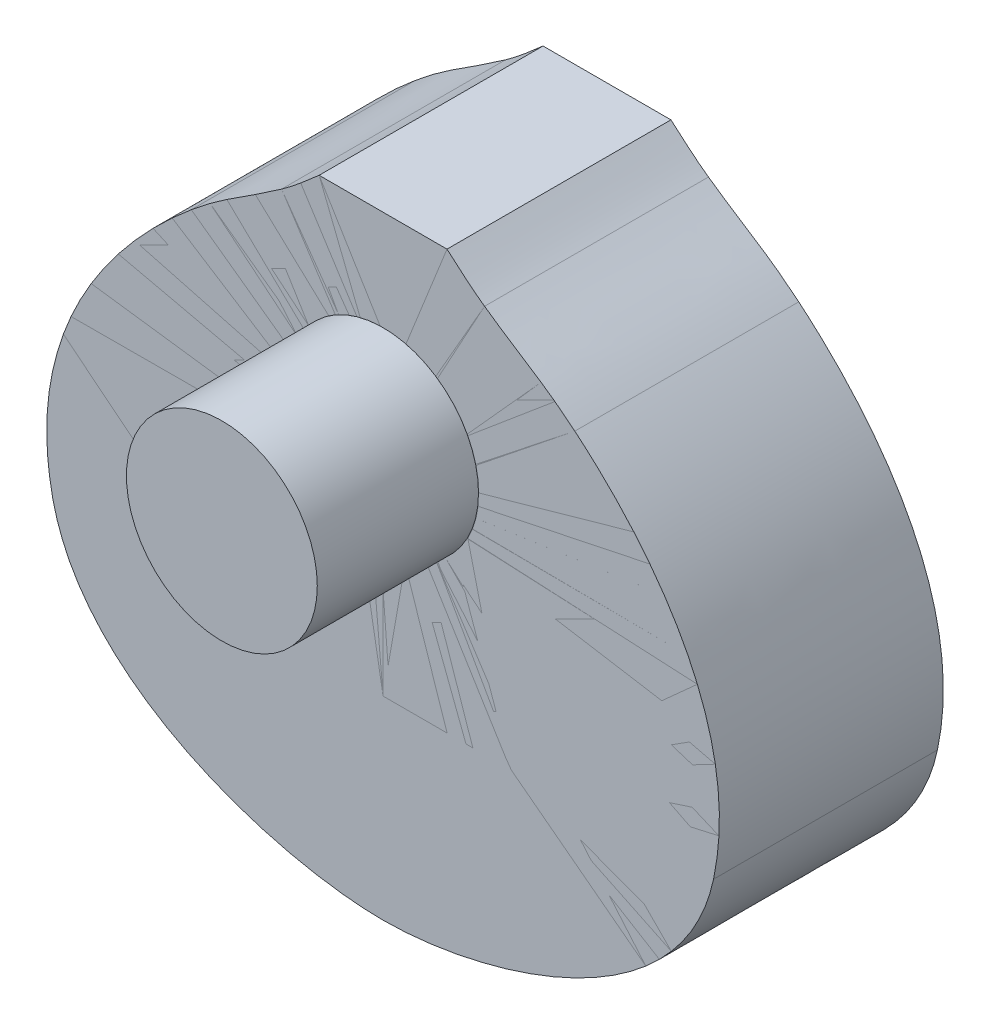
ISO-10303-21;
HEADER;
FILE_DESCRIPTION(('STEP AP214'),'2;1');
FILE_NAME('part.step','',(''),(''),'','','');
FILE_SCHEMA(('AUTOMOTIVE_DESIGN { 1 0 10303 214 1 1 1 1 }'));
ENDSEC;
DATA;
#1=APPLICATION_CONTEXT('core data for automotive mechanical design processes');
#2=APPLICATION_PROTOCOL_DEFINITION('international standard','automotive_design',2000,#1);
#3=PRODUCT_CONTEXT('',#1,'mechanical');
#4=PRODUCT('Part','Part','',(#3));
#5=PRODUCT_RELATED_PRODUCT_CATEGORY('part','',(#4));
#6=PRODUCT_DEFINITION_FORMATION('','',#4);
#7=PRODUCT_DEFINITION_CONTEXT('part definition',#1,'design');
#8=PRODUCT_DEFINITION('design','',#6,#7);
#9=PRODUCT_DEFINITION_SHAPE('','',#8);
#10=(LENGTH_UNIT() NAMED_UNIT(*) SI_UNIT(.MILLI.,.METRE.));
#11=(NAMED_UNIT(*) PLANE_ANGLE_UNIT() SI_UNIT($,.RADIAN.));
#12=(NAMED_UNIT(*) SI_UNIT($,.STERADIAN.) SOLID_ANGLE_UNIT());
#13=UNCERTAINTY_MEASURE_WITH_UNIT(LENGTH_MEASURE(1.E-05),#10,'distance_accuracy_value','');
#14=(GEOMETRIC_REPRESENTATION_CONTEXT(3) GLOBAL_UNCERTAINTY_ASSIGNED_CONTEXT((#13)) GLOBAL_UNIT_ASSIGNED_CONTEXT((#10,
#11,#12)) REPRESENTATION_CONTEXT('',''));
#15=CARTESIAN_POINT('',(0.,0.,0.));
#16=DIRECTION('',(0.,0.,1.));
#17=DIRECTION('',(1.,0.,0.));
#18=AXIS2_PLACEMENT_3D('',#15,#16,#17);
#19=CARTESIAN_POINT('',(2.54000051894132E-07,-50.2300828757145,100.));
#20=DIRECTION('',(0.,0.,1.));
#21=DIRECTION('',(1.,0.,0.));
#22=AXIS2_PLACEMENT_3D('',#19,#20,#21);
#23=PLANE('',#22);
#24=DIRECTION('',(0.,1.,0.));
#25=VECTOR('',#24,1.);
#26=CARTESIAN_POINT('',(2.54000051894132E-07,-80.2300828757145,100.));
#27=LINE('',#26,#25);
#28=CARTESIAN_POINT('',(2.54000051894132E-07,-80.2300828757145,100.));
#29=VERTEX_POINT('',#28);
#30=CARTESIAN_POINT('',(2.54000051894132E-07,-50.2300828757145,100.));
#31=VERTEX_POINT('',#30);
#32=EDGE_CURVE('E53',#29,#31,#27,.T.);
#33=ORIENTED_EDGE('',*,*,#32,.T.);
#34=DIRECTION('',(-1.,0.,0.));
#35=VECTOR('',#34,1.);
#36=CARTESIAN_POINT('',(2.54000051894132E-07,-50.2300828757145,100.));
#37=LINE('',#36,#35);
#38=CARTESIAN_POINT('',(-57.199999746,-50.2300828757146,100.));
#39=VERTEX_POINT('',#38);
#40=EDGE_CURVE('E64',#31,#39,#37,.T.);
#41=ORIENTED_EDGE('',*,*,#40,.T.);
#42=DIRECTION('',(0.,-1.,0.));
#43=VECTOR('',#42,1.);
#44=CARTESIAN_POINT('',(-57.199999746,-50.2300828757146,100.));
#45=LINE('',#44,#43);
#46=CARTESIAN_POINT('',(-57.199999746,-80.2300828757145,100.));
#47=VERTEX_POINT('',#46);
#48=EDGE_CURVE('E49',#39,#47,#45,.T.);
#49=ORIENTED_EDGE('',*,*,#48,.T.);
#50=DIRECTION('',(1.,0.,0.));
#51=VECTOR('',#50,1.);
#52=CARTESIAN_POINT('',(-57.199999746,-80.2300828757145,100.));
#53=LINE('',#52,#51);
#54=EDGE_CURVE('E12',#47,#29,#53,.T.);
#55=ORIENTED_EDGE('',*,*,#54,.T.);
#56=EDGE_LOOP('',(#33,#41,#49,#55));
#57=FACE_BOUND('',#56,.T.);
#58=ADVANCED_FACE('F44',(#57),#23,.T.);
#59=OPEN_SHELL('',(#58));
#60=SHELL_BASED_SURFACE_MODEL('B2',(#59));
#61=CARTESIAN_POINT('',(-86.0503424550161,-116.244162405099,100.));
#62=DIRECTION('',(0.,0.,1.));
#63=DIRECTION('',(1.,0.,0.));
#64=AXIS2_PLACEMENT_3D('',#61,#62,#63);
#65=PLANE('',#64);
#66=CARTESIAN_POINT('',(-147.578497619594,-47.2764964103053,100.));
#67=CARTESIAN_POINT('',(-133.833406644178,-111.670406770875,100.));
#68=CARTESIAN_POINT('',(-46.441340696,-136.916395601955,100.));
#69=CARTESIAN_POINT('',(0.,-136.916395712,100.));
#70=B_SPLINE_CURVE_WITH_KNOTS('',3,(#66,#67,#68,#69),.UNSPECIFIED.,.F.,.F.,(4,4),(0.,1.),.UNSPECIFIED.);
#71=CARTESIAN_POINT('',(-147.578497619594,-47.2764964103053,100.));
#72=VERTEX_POINT('',#71);
#73=CARTESIAN_POINT('',(0.,-136.916395712,100.));
#74=VERTEX_POINT('',#73);
#75=EDGE_CURVE('E109',#72,#74,#70,.T.);
#76=ORIENTED_EDGE('',*,*,#75,.T.);
#77=DIRECTION('',(4.48079939714113E-09,1.,0.));
#78=VECTOR('',#77,1.);
#79=CARTESIAN_POINT('',(2.54000051894132E-07,-80.2300828757145,100.));
#80=LINE('',#79,#78);
#81=CARTESIAN_POINT('',(2.54000051894132E-07,-80.2300828757145,100.));
#82=VERTEX_POINT('',#81);
#83=EDGE_CURVE('E144',#74,#82,#80,.T.);
#84=ORIENTED_EDGE('',*,*,#83,.T.);
#85=DIRECTION('',(-1.,0.,0.));
#86=VECTOR('',#85,1.);
#87=CARTESIAN_POINT('',(2.54000051894132E-07,-80.2300828757145,100.));
#88=LINE('',#87,#86);
#89=CARTESIAN_POINT('',(-57.199999746,-80.2300828757145,100.));
#90=VERTEX_POINT('',#89);
#91=EDGE_CURVE('E149',#82,#90,#88,.T.);
#92=ORIENTED_EDGE('',*,*,#91,.T.);
#93=DIRECTION('',(0.,1.,0.));
#94=VECTOR('',#93,1.);
#95=CARTESIAN_POINT('',(-57.199999746,-80.2300828757145,100.));
#96=LINE('',#95,#94);
#97=CARTESIAN_POINT('',(-57.199999746,-50.2300828757146,100.));
#98=VERTEX_POINT('',#97);
#99=EDGE_CURVE('E154',#90,#98,#96,.T.);
#100=ORIENTED_EDGE('',*,*,#99,.T.);
#101=DIRECTION('',(1.,0.,0.));
#102=VECTOR('',#101,1.);
#103=CARTESIAN_POINT('',(2.54000051894132E-07,-50.2300828757145,100.));
#104=LINE('',#103,#102);
#105=CARTESIAN_POINT('',(2.54000051894132E-07,-50.2300828757145,100.));
#106=VERTEX_POINT('',#105);
#107=EDGE_CURVE('E161',#98,#106,#104,.T.);
#108=ORIENTED_EDGE('',*,*,#107,.T.);
#109=DIRECTION('',(-4.45614126130056E-09,1.,0.));
#110=VECTOR('',#109,1.);
#111=CARTESIAN_POINT('',(0.,6.76991712428551,100.));
#112=LINE('',#111,#110);
#113=CARTESIAN_POINT('',(0.,6.76991712428551,100.));
#114=VERTEX_POINT('',#113);
#115=EDGE_CURVE('E164',#106,#114,#112,.T.);
#116=ORIENTED_EDGE('',*,*,#115,.T.);
#117=CARTESIAN_POINT('',(0.,49.5382312132487,100.));
#118=DIRECTION('',(0.,0.,-1.));
#119=DIRECTION('',(1.,0.,0.));
#120=AXIS2_PLACEMENT_3D('',#117,#118,#119);
#121=CIRCLE('',#120,42.7683140889631);
#122=CARTESIAN_POINT('',(0.,92.3065453022118,100.));
#123=VERTEX_POINT('',#122);
#124=EDGE_CURVE('E167',#114,#123,#121,.T.);
#125=ORIENTED_EDGE('',*,*,#124,.T.);
#126=DIRECTION('',(0.,1.,0.));
#127=VECTOR('',#126,1.);
#128=CARTESIAN_POINT('',(0.,136.916395712,100.));
#129=LINE('',#128,#127);
#130=CARTESIAN_POINT('',(0.,136.916395712,100.));
#131=VERTEX_POINT('',#130);
#132=EDGE_CURVE('E170',#123,#131,#129,.T.);
#133=ORIENTED_EDGE('',*,*,#132,.T.);
#134=DIRECTION('',(-1.,0.,0.));
#135=VECTOR('',#134,1.);
#136=CARTESIAN_POINT('',(-28.560802416,136.916395712,100.));
#137=LINE('',#136,#135);
#138=CARTESIAN_POINT('',(-28.560802416,136.916395712,100.));
#139=VERTEX_POINT('',#138);
#140=EDGE_CURVE('E173',#131,#139,#137,.T.);
#141=ORIENTED_EDGE('',*,*,#140,.T.);
#142=CARTESIAN_POINT('',(-28.560802416,136.916395712,100.));
#143=CARTESIAN_POINT('',(-33.9335231919999,132.194713512,100.));
#144=CARTESIAN_POINT('',(-39.502343144,127.304974752,100.));
#145=CARTESIAN_POINT('',(-45.32320628,123.188624336,100.));
#146=B_SPLINE_CURVE_WITH_KNOTS('',3,(#142,#143,#144,#145),.UNSPECIFIED.,.F.,.F.,(4,4),(0.,1.),.UNSPECIFIED.);
#147=CARTESIAN_POINT('',(-45.32320628,123.188624336,100.));
#148=VERTEX_POINT('',#147);
#149=EDGE_CURVE('E176',#139,#148,#146,.T.);
#150=ORIENTED_EDGE('',*,*,#149,.T.);
#151=CARTESIAN_POINT('',(-45.32320628,123.188624336,100.));
#152=CARTESIAN_POINT('',(-62.7857662239999,110.83954464,100.));
#153=CARTESIAN_POINT('',(-70.778696136,107.475422336,100.));
#154=CARTESIAN_POINT('',(-85.639397936,95.0587593360001,100.));
#155=B_SPLINE_CURVE_WITH_KNOTS('',3,(#151,#152,#153,#154),.UNSPECIFIED.,.F.,.F.,(4,4),(0.,1.),.UNSPECIFIED.);
#156=CARTESIAN_POINT('',(-85.639397936,95.0587593360001,100.));
#157=VERTEX_POINT('',#156);
#158=EDGE_CURVE('E105',#148,#157,#155,.T.);
#159=ORIENTED_EDGE('',*,*,#158,.T.);
#160=CARTESIAN_POINT('',(-85.639397936,95.0587593360001,100.));
#161=CARTESIAN_POINT('',(-105.36071799703,78.5808853673423,100.));
#162=CARTESIAN_POINT('',(-163.110192840785,25.4872575653832,100.));
#163=CARTESIAN_POINT('',(-147.578497619594,-47.2764964103053,100.));
#164=B_SPLINE_CURVE_WITH_KNOTS('',3,(#160,#161,#162,#163),.UNSPECIFIED.,.F.,.F.,(4,4),(0.,1.),.UNSPECIFIED.);
#165=EDGE_CURVE('E42',#157,#72,#164,.T.);
#166=ORIENTED_EDGE('',*,*,#165,.T.);
#167=EDGE_LOOP('',(#76,#84,#92,#100,#108,#116,#125,#133,#141,#150,#159,#166));
#168=FACE_BOUND('',#167,.T.);
#169=ADVANCED_FACE('F98',(#168),#65,.T.);
#170=OPEN_SHELL('',(#169));
#171=SHELL_BASED_SURFACE_MODEL('B6',(#170));
#172=CARTESIAN_POINT('',(2.54000051894132E-07,-50.2300828757145,100.));
#173=DIRECTION('',(0.,0.,1.));
#174=DIRECTION('',(1.,0.,0.));
#175=AXIS2_PLACEMENT_3D('',#172,#173,#174);
#176=PLANE('',#175);
#177=DIRECTION('',(-1.,0.,0.));
#178=VECTOR('',#177,1.);
#179=CARTESIAN_POINT('',(57.2820243491385,-50.2300828757145,100.));
#180=LINE('',#179,#178);
#181=CARTESIAN_POINT('',(57.2820243491385,-50.2300828757145,100.));
#182=VERTEX_POINT('',#181);
#183=CARTESIAN_POINT('',(2.54000051894132E-07,-50.2300828757145,100.));
#184=VERTEX_POINT('',#183);
#185=EDGE_CURVE('E253',#182,#184,#180,.T.);
#186=ORIENTED_EDGE('',*,*,#185,.T.);
#187=DIRECTION('',(0.,-1.,0.));
#188=VECTOR('',#187,1.);
#189=CARTESIAN_POINT('',(2.54000051894132E-07,-50.2300828757145,100.));
#190=LINE('',#189,#188);
#191=CARTESIAN_POINT('',(2.54000051894132E-07,-80.2300828757145,100.));
#192=VERTEX_POINT('',#191);
#193=EDGE_CURVE('E264',#184,#192,#190,.T.);
#194=ORIENTED_EDGE('',*,*,#193,.T.);
#195=DIRECTION('',(1.,0.,0.));
#196=VECTOR('',#195,1.);
#197=CARTESIAN_POINT('',(2.54000051894132E-07,-80.2300828757145,100.));
#198=LINE('',#197,#196);
#199=CARTESIAN_POINT('',(57.2820243491385,-80.2300828757145,100.));
#200=VERTEX_POINT('',#199);
#201=EDGE_CURVE('E249',#192,#200,#198,.T.);
#202=ORIENTED_EDGE('',*,*,#201,.T.);
#203=DIRECTION('',(0.,1.,0.));
#204=VECTOR('',#203,1.);
#205=CARTESIAN_POINT('',(57.2820243491385,-80.2300828757145,100.));
#206=LINE('',#205,#204);
#207=EDGE_CURVE('E96',#200,#182,#206,.T.);
#208=ORIENTED_EDGE('',*,*,#207,.T.);
#209=EDGE_LOOP('',(#186,#194,#202,#208));
#210=FACE_BOUND('',#209,.T.);
#211=ADVANCED_FACE('F244',(#210),#176,.T.);
#212=OPEN_SHELL('',(#211));
#213=SHELL_BASED_SURFACE_MODEL('B36',(#212));
#214=CARTESIAN_POINT('',(2.54000051894132E-07,49.5382312132486,100.));
#215=DIRECTION('',(0.,0.,-1.));
#216=DIRECTION('',(-1.,0.,0.));
#217=AXIS2_PLACEMENT_3D('',#214,#215,#216);
#218=PLANE('',#217);
#219=DIRECTION('',(-1.,0.,0.));
#220=VECTOR('',#219,1.);
#221=CARTESIAN_POINT('',(28.5608026699999,136.916395712,100.));
#222=LINE('',#221,#220);
#223=CARTESIAN_POINT('',(28.5608026699999,136.916395712,100.));
#224=VERTEX_POINT('',#223);
#225=CARTESIAN_POINT('',(2.54000051894132E-07,136.916395712,100.));
#226=VERTEX_POINT('',#225);
#227=EDGE_CURVE('E308',#224,#226,#222,.T.);
#228=ORIENTED_EDGE('',*,*,#227,.T.);
#229=DIRECTION('',(0.,-1.,0.));
#230=VECTOR('',#229,1.);
#231=CARTESIAN_POINT('',(2.54000051894132E-07,136.916395712,100.));
#232=LINE('',#231,#230);
#233=CARTESIAN_POINT('',(2.54000051894132E-07,92.3065453022117,100.));
#234=VERTEX_POINT('',#233);
#235=EDGE_CURVE('E346',#226,#234,#232,.T.);
#236=ORIENTED_EDGE('',*,*,#235,.T.);
#237=CARTESIAN_POINT('',(2.54000051894132E-07,49.5382312132486,100.));
#238=DIRECTION('',(0.,0.,-1.));
#239=DIRECTION('',(-1.,0.,0.));
#240=AXIS2_PLACEMENT_3D('',#237,#238,#239);
#241=CIRCLE('',#240,42.7683140889631);
#242=CARTESIAN_POINT('',(2.54000059750544E-07,6.76991712428546,100.));
#243=VERTEX_POINT('',#242);
#244=EDGE_CURVE('E351',#234,#243,#241,.T.);
#245=ORIENTED_EDGE('',*,*,#244,.T.);
#246=DIRECTION('',(0.,-1.,0.));
#247=VECTOR('',#246,1.);
#248=CARTESIAN_POINT('',(2.54000051894132E-07,6.76991712428546,100.));
#249=LINE('',#248,#247);
#250=CARTESIAN_POINT('',(2.54000051894132E-07,-50.2300828757145,100.));
#251=VERTEX_POINT('',#250);
#252=EDGE_CURVE('E356',#243,#251,#249,.T.);
#253=ORIENTED_EDGE('',*,*,#252,.T.);
#254=DIRECTION('',(1.,0.,0.));
#255=VECTOR('',#254,1.);
#256=CARTESIAN_POINT('',(57.2820243491385,-50.2300828757145,100.));
#257=LINE('',#256,#255);
#258=CARTESIAN_POINT('',(57.2820243491385,-50.2300828757145,100.));
#259=VERTEX_POINT('',#258);
#260=EDGE_CURVE('E361',#251,#259,#257,.T.);
#261=ORIENTED_EDGE('',*,*,#260,.T.);
#262=DIRECTION('',(0.,-1.,0.));
#263=VECTOR('',#262,1.);
#264=CARTESIAN_POINT('',(57.2820243491385,-50.2300828757145,100.));
#265=LINE('',#264,#263);
#266=CARTESIAN_POINT('',(57.2820243491385,-80.2300828757145,100.));
#267=VERTEX_POINT('',#266);
#268=EDGE_CURVE('E364',#259,#267,#265,.T.);
#269=ORIENTED_EDGE('',*,*,#268,.T.);
#270=DIRECTION('',(-1.,0.,0.));
#271=VECTOR('',#270,1.);
#272=CARTESIAN_POINT('',(2.54000051894132E-07,-80.2300828757145,100.));
#273=LINE('',#272,#271);
#274=CARTESIAN_POINT('',(2.54000051894132E-07,-80.2300828757145,100.));
#275=VERTEX_POINT('',#274);
#276=EDGE_CURVE('E367',#267,#275,#273,.T.);
#277=ORIENTED_EDGE('',*,*,#276,.T.);
#278=DIRECTION('',(0.00354647384552685,-0.999993711241857,0.));
#279=VECTOR('',#278,1.);
#280=CARTESIAN_POINT('',(2.54000051894132E-07,-80.2300828757145,100.));
#281=LINE('',#280,#279);
#282=CARTESIAN_POINT('',(0.198125947321853,-136.095276300763,100.));
#283=VERTEX_POINT('',#282);
#284=EDGE_CURVE('E370',#275,#283,#281,.T.);
#285=ORIENTED_EDGE('',*,*,#284,.T.);
#286=DIRECTION('',(-0.234556021648492,-0.972102604002495,0.));
#287=VECTOR('',#286,1.);
#288=CARTESIAN_POINT('',(2.5399994087183E-07,-136.916395712,100.));
#289=LINE('',#288,#287);
#290=CARTESIAN_POINT('',(2.5399994087183E-07,-136.916395712,100.));
#291=VERTEX_POINT('',#290);
#292=EDGE_CURVE('E373',#283,#291,#289,.T.);
#293=ORIENTED_EDGE('',*,*,#292,.T.);
#294=CARTESIAN_POINT('',(2.5399994087183E-07,-136.916395712,100.));
#295=CARTESIAN_POINT('',(46.4413409500002,-136.916395601955,100.));
#296=CARTESIAN_POINT('',(133.833406898179,-111.670406770875,100.));
#297=CARTESIAN_POINT('',(147.578497873594,-47.2764964103053,100.));
#298=B_SPLINE_CURVE_WITH_KNOTS('',3,(#294,#295,#296,#297),.UNSPECIFIED.,.F.,.F.,(4,4),(0.,1.),.UNSPECIFIED.);
#299=CARTESIAN_POINT('',(147.578497873594,-47.2764964103053,100.));
#300=VERTEX_POINT('',#299);
#301=EDGE_CURVE('E376',#291,#300,#298,.T.);
#302=ORIENTED_EDGE('',*,*,#301,.T.);
#303=CARTESIAN_POINT('',(147.578497873594,-47.2764964103053,100.));
#304=CARTESIAN_POINT('',(163.110193094786,25.4872575653832,100.));
#305=CARTESIAN_POINT('',(105.36071825103,78.5808853673423,100.));
#306=CARTESIAN_POINT('',(85.63939819,95.0587593360001,100.));
#307=B_SPLINE_CURVE_WITH_KNOTS('',3,(#303,#304,#305,#306),.UNSPECIFIED.,.F.,.F.,(4,4),(0.,1.),.UNSPECIFIED.);
#308=CARTESIAN_POINT('',(85.63939819,95.0587593360001,100.));
#309=VERTEX_POINT('',#308);
#310=EDGE_CURVE('E381',#300,#309,#307,.T.);
#311=ORIENTED_EDGE('',*,*,#310,.T.);
#312=CARTESIAN_POINT('',(85.63939819,95.0587593360001,100.));
#313=CARTESIAN_POINT('',(70.77869639,107.475422336,100.));
#314=CARTESIAN_POINT('',(62.7857664779999,110.83954464,100.));
#315=CARTESIAN_POINT('',(45.323206534,123.188624336,100.));
#316=B_SPLINE_CURVE_WITH_KNOTS('',3,(#312,#313,#314,#315),.UNSPECIFIED.,.F.,.F.,(4,4),(0.,1.),.UNSPECIFIED.);
#317=CARTESIAN_POINT('',(45.323206534,123.188624336,100.));
#318=VERTEX_POINT('',#317);
#319=EDGE_CURVE('E304',#309,#318,#316,.T.);
#320=ORIENTED_EDGE('',*,*,#319,.T.);
#321=CARTESIAN_POINT('',(45.323206534,123.188624336,100.));
#322=CARTESIAN_POINT('',(39.502343398,127.304974752,100.));
#323=CARTESIAN_POINT('',(33.933523446,132.194713512,100.));
#324=CARTESIAN_POINT('',(28.5608026699999,136.916395712,100.));
#325=B_SPLINE_CURVE_WITH_KNOTS('',3,(#321,#322,#323,#324),.UNSPECIFIED.,.F.,.F.,(4,4),(0.,1.),.UNSPECIFIED.);
#326=EDGE_CURVE('E242',#318,#224,#325,.T.);
#327=ORIENTED_EDGE('',*,*,#326,.T.);
#328=EDGE_LOOP('',(#228,#236,#245,#253,#261,#269,#277,#285,#293,#302,#311,#320,#327));
#329=FACE_BOUND('',#328,.T.);
#330=ADVANCED_FACE('F297',(#329),#218,.F.);
#331=OPEN_SHELL('',(#330));
#332=SHELL_BASED_SURFACE_MODEL('B90',(#331));
#333=CARTESIAN_POINT('',(-86.0503422010161,-116.244162405099,100.));
#334=DIRECTION('',(0.,0.,1.));
#335=DIRECTION('',(1.,0.,0.));
#336=AXIS2_PLACEMENT_3D('',#333,#334,#335);
#337=PLANE('',#336);
#338=CARTESIAN_POINT('',(-147.578497365594,-47.2764964103054,100.));
#339=CARTESIAN_POINT('',(-133.833406390178,-111.670406770875,100.));
#340=CARTESIAN_POINT('',(-46.441340442,-136.916395601955,100.));
#341=CARTESIAN_POINT('',(2.54000087163701E-07,-136.916395712,100.));
#342=B_SPLINE_CURVE_WITH_KNOTS('',3,(#338,#339,#340,#341),.UNSPECIFIED.,.F.,.F.,(4,4),(0.,1.),.UNSPECIFIED.);
#343=CARTESIAN_POINT('',(-147.578497365594,-47.2764964103054,100.));
#344=VERTEX_POINT('',#343);
#345=CARTESIAN_POINT('',(2.53999985488917E-07,-136.916395712,100.));
#346=VERTEX_POINT('',#345);
#347=EDGE_CURVE('E493',#344,#346,#342,.T.);
#348=ORIENTED_EDGE('',*,*,#347,.T.);
#349=CARTESIAN_POINT('',(0.,-136.916395712,100.));
#350=CARTESIAN_POINT('',(46.4413406959999,-136.916395629466,100.));
#351=CARTESIAN_POINT('',(133.833406659134,-111.670406850156,100.));
#352=CARTESIAN_POINT('',(147.578497672695,-47.2764964977289,100.));
#353=B_SPLINE_CURVE_WITH_KNOTS('',3,(#349,#350,#351,#352),.UNSPECIFIED.,.F.,.F.,(4,4),(0.,1.),.UNSPECIFIED.);
#354=CARTESIAN_POINT('',(147.578497672695,-47.2764964977289,100.));
#355=VERTEX_POINT('',#354);
#356=EDGE_CURVE('E628',#346,#355,#353,.T.);
#357=ORIENTED_EDGE('',*,*,#356,.T.);
#358=CARTESIAN_POINT('',(147.578497672695,-47.2764964977289,100.));
#359=CARTESIAN_POINT('',(163.110192996589,25.4872574560373,100.));
#360=CARTESIAN_POINT('',(105.360718227773,78.5808853395067,100.));
#361=CARTESIAN_POINT('',(85.63939819,95.058759336,100.));
#362=B_SPLINE_CURVE_WITH_KNOTS('',3,(#358,#359,#360,#361),.UNSPECIFIED.,.F.,.F.,(4,4),(0.,1.),.UNSPECIFIED.);
#363=CARTESIAN_POINT('',(85.63939819,95.058759336,100.));
#364=VERTEX_POINT('',#363);
#365=EDGE_CURVE('E639',#355,#364,#362,.T.);
#366=ORIENTED_EDGE('',*,*,#365,.T.);
#367=CARTESIAN_POINT('',(85.63939819,95.058759336,100.));
#368=CARTESIAN_POINT('',(70.77869639,107.475422336,100.));
#369=CARTESIAN_POINT('',(62.785766478,110.83954464,100.));
#370=CARTESIAN_POINT('',(45.323206534,123.188624336,100.));
#371=B_SPLINE_CURVE_WITH_KNOTS('',3,(#367,#368,#369,#370),.UNSPECIFIED.,.F.,.F.,(4,4),(0.,1.),.UNSPECIFIED.);
#372=CARTESIAN_POINT('',(45.323206534,123.188624336,100.));
#373=VERTEX_POINT('',#372);
#374=EDGE_CURVE('E688',#364,#373,#371,.T.);
#375=ORIENTED_EDGE('',*,*,#374,.T.);
#376=CARTESIAN_POINT('',(45.323206534,123.188624336,100.));
#377=CARTESIAN_POINT('',(39.502343398,127.304974752,100.));
#378=CARTESIAN_POINT('',(33.933523446,132.194713512,100.));
#379=CARTESIAN_POINT('',(28.56080267,136.916395712,100.));
#380=B_SPLINE_CURVE_WITH_KNOTS('',3,(#376,#377,#378,#379),.UNSPECIFIED.,.F.,.F.,(4,4),(0.,1.),.UNSPECIFIED.);
#381=CARTESIAN_POINT('',(28.56080267,136.916395712,100.));
#382=VERTEX_POINT('',#381);
#383=EDGE_CURVE('E669',#373,#382,#380,.T.);
#384=ORIENTED_EDGE('',*,*,#383,.T.);
#385=DIRECTION('',(-1.,0.,0.));
#386=VECTOR('',#385,1.);
#387=CARTESIAN_POINT('',(-28.5608021619999,136.916395712,100.));
#388=LINE('',#387,#386);
#389=CARTESIAN_POINT('',(-28.5608021619999,136.916395712,100.));
#390=VERTEX_POINT('',#389);
#391=EDGE_CURVE('E509',#382,#390,#388,.T.);
#392=ORIENTED_EDGE('',*,*,#391,.T.);
#393=CARTESIAN_POINT('',(-28.5608021619999,136.916395712,100.));
#394=CARTESIAN_POINT('',(-33.9335229379999,132.194713512,100.));
#395=CARTESIAN_POINT('',(-39.5023428899999,127.304974752,100.));
#396=CARTESIAN_POINT('',(-45.3232060259999,123.188624336,100.));
#397=B_SPLINE_CURVE_WITH_KNOTS('',3,(#393,#394,#395,#396),.UNSPECIFIED.,.F.,.F.,(4,4),(0.,1.),.UNSPECIFIED.);
#398=CARTESIAN_POINT('',(-45.3232060259999,123.188624336,100.));
#399=VERTEX_POINT('',#398);
#400=EDGE_CURVE('E502',#390,#399,#397,.T.);
#401=ORIENTED_EDGE('',*,*,#400,.T.);
#402=CARTESIAN_POINT('',(-45.3232060259999,123.188624336,100.));
#403=CARTESIAN_POINT('',(-62.7857659699999,110.83954464,100.));
#404=CARTESIAN_POINT('',(-70.7786958819999,107.475422336,100.));
#405=CARTESIAN_POINT('',(-85.6393976819999,95.058759336,100.));
#406=B_SPLINE_CURVE_WITH_KNOTS('',3,(#402,#403,#404,#405),.UNSPECIFIED.,.F.,.F.,(4,4),(0.,1.),.UNSPECIFIED.);
#407=CARTESIAN_POINT('',(-85.6393976819999,95.058759336,100.));
#408=VERTEX_POINT('',#407);
#409=EDGE_CURVE('E506',#399,#408,#406,.T.);
#410=ORIENTED_EDGE('',*,*,#409,.T.);
#411=CARTESIAN_POINT('',(-85.6393976819999,95.058759336,100.));
#412=CARTESIAN_POINT('',(-105.36071774303,78.5808853673423,100.));
#413=CARTESIAN_POINT('',(-163.110192586785,25.4872575653832,100.));
#414=CARTESIAN_POINT('',(-147.578497365594,-47.2764964103054,100.));
#415=B_SPLINE_CURVE_WITH_KNOTS('',3,(#411,#412,#413,#414),.UNSPECIFIED.,.F.,.F.,(4,4),(0.,1.),.UNSPECIFIED.);
#416=EDGE_CURVE('E460',#408,#344,#415,.T.);
#417=ORIENTED_EDGE('',*,*,#416,.T.);
#418=EDGE_LOOP('',(#348,#357,#366,#375,#384,#392,#401,#410,#417));
#419=FACE_BOUND('',#418,.T.);
#420=CARTESIAN_POINT('',(2.54000031916041E-07,49.6594816289135,100.));
#421=DIRECTION('',(0.,0.,1.));
#422=DIRECTION('',(1.,0.,0.));
#423=AXIS2_PLACEMENT_3D('',#420,#421,#422);
#424=CIRCLE('',#423,42.6235073127831);
#425=CARTESIAN_POINT('',(42.6235075667832,49.6594816289135,100.));
#426=VERTEX_POINT('',#425);
#427=EDGE_CURVE('E701',#426,#426,#424,.T.);
#428=ORIENTED_EDGE('',*,*,#427,.F.);
#429=EDGE_LOOP('',(#428));
#430=FACE_BOUND('',#429,.T.);
#431=ADVANCED_FACE('F442',(#419,#430),#337,.T.);
#432=DIRECTION('',(0.,0.,-1.));
#433=VECTOR('',#432,1.);
#434=SURFACE_OF_LINEAR_EXTRUSION('',#342,#433);
#435=CARTESIAN_POINT('',(-147.578497365594,-47.2764964103054,0.));
#436=CARTESIAN_POINT('',(-133.833406390178,-111.670406770875,0.));
#437=CARTESIAN_POINT('',(-46.441340442,-136.916395601955,0.));
#438=CARTESIAN_POINT('',(2.54000087163701E-07,-136.916395712,0.));
#439=B_SPLINE_CURVE_WITH_KNOTS('',3,(#435,#436,#437,#438),.UNSPECIFIED.,.F.,.F.,(4,4),(0.,1.),.UNSPECIFIED.);
#440=CARTESIAN_POINT('',(-147.578497365594,-47.2764964103054,0.));
#441=VERTEX_POINT('',#440);
#442=CARTESIAN_POINT('',(2.53999985488917E-07,-136.916395712,0.));
#443=VERTEX_POINT('',#442);
#444=EDGE_CURVE('E571',#441,#443,#439,.T.);
#445=ORIENTED_EDGE('',*,*,#444,.T.);
#446=DIRECTION('',(0.,0.,-1.));
#447=VECTOR('',#446,1.);
#448=CARTESIAN_POINT('',(2.53999985488917E-07,-136.916395712,100.));
#449=LINE('',#448,#447);
#450=EDGE_CURVE('E295',#346,#443,#449,.T.);
#451=ORIENTED_EDGE('',*,*,#450,.F.);
#452=ORIENTED_EDGE('',*,*,#347,.F.);
#453=DIRECTION('',(0.,0.,-1.));
#454=VECTOR('',#453,1.);
#455=CARTESIAN_POINT('',(-147.578497365594,-47.2764964103054,100.));
#456=LINE('',#455,#454);
#457=EDGE_CURVE('E522',#344,#441,#456,.T.);
#458=ORIENTED_EDGE('',*,*,#457,.T.);
#459=EDGE_LOOP('',(#445,#451,#452,#458));
#460=FACE_BOUND('',#459,.T.);
#461=ADVANCED_FACE('F444',(#460),#434,.F.);
#462=CARTESIAN_POINT('',(-28.5608021619999,136.916395712,100.));
#463=DIRECTION('',(0.,-1.,0.));
#464=DIRECTION('',(0.,0.,-1.));
#465=AXIS2_PLACEMENT_3D('',#462,#463,#464);
#466=PLANE('',#465);
#467=DIRECTION('',(-1.,0.,0.));
#468=VECTOR('',#467,1.);
#469=CARTESIAN_POINT('',(-28.5608021619999,136.916395712,0.));
#470=LINE('',#469,#468);
#471=CARTESIAN_POINT('',(28.56080267,136.916395712,0.));
#472=VERTEX_POINT('',#471);
#473=CARTESIAN_POINT('',(-28.5608021619999,136.916395712,0.));
#474=VERTEX_POINT('',#473);
#475=EDGE_CURVE('E575',#472,#474,#470,.T.);
#476=ORIENTED_EDGE('',*,*,#475,.T.);
#477=DIRECTION('',(0.,0.,-1.));
#478=VECTOR('',#477,1.);
#479=CARTESIAN_POINT('',(-28.5608021619999,136.916395712,100.));
#480=LINE('',#479,#478);
#481=EDGE_CURVE('E452',#390,#474,#480,.T.);
#482=ORIENTED_EDGE('',*,*,#481,.F.);
#483=ORIENTED_EDGE('',*,*,#391,.F.);
#484=DIRECTION('',(0.,0.,-1.));
#485=VECTOR('',#484,1.);
#486=CARTESIAN_POINT('',(28.56080267,136.916395712,100.));
#487=LINE('',#486,#485);
#488=EDGE_CURVE('E620',#382,#472,#487,.T.);
#489=ORIENTED_EDGE('',*,*,#488,.T.);
#490=EDGE_LOOP('',(#476,#482,#483,#489));
#491=FACE_BOUND('',#490,.T.);
#492=ADVANCED_FACE('F545',(#491),#466,.F.);
#493=DIRECTION('',(0.,0.,-1.));
#494=VECTOR('',#493,1.);
#495=SURFACE_OF_LINEAR_EXTRUSION('',#397,#494);
#496=CARTESIAN_POINT('',(-28.5608021619999,136.916395712,0.));
#497=CARTESIAN_POINT('',(-33.9335229379999,132.194713512,0.));
#498=CARTESIAN_POINT('',(-39.5023428899999,127.304974752,0.));
#499=CARTESIAN_POINT('',(-45.3232060259999,123.188624336,0.));
#500=B_SPLINE_CURVE_WITH_KNOTS('',3,(#496,#497,#498,#499),.UNSPECIFIED.,.F.,.F.,(4,4),(0.,1.),.UNSPECIFIED.);
#501=CARTESIAN_POINT('',(-45.3232060259999,123.188624336,0.));
#502=VERTEX_POINT('',#501);
#503=EDGE_CURVE('E517',#474,#502,#500,.T.);
#504=ORIENTED_EDGE('',*,*,#503,.T.);
#505=DIRECTION('',(0.,0.,-1.));
#506=VECTOR('',#505,1.);
#507=CARTESIAN_POINT('',(-45.3232060259999,123.188624336,100.));
#508=LINE('',#507,#506);
#509=EDGE_CURVE('E514',#399,#502,#508,.T.);
#510=ORIENTED_EDGE('',*,*,#509,.F.);
#511=ORIENTED_EDGE('',*,*,#400,.F.);
#512=ORIENTED_EDGE('',*,*,#481,.T.);
#513=EDGE_LOOP('',(#504,#510,#511,#512));
#514=FACE_BOUND('',#513,.T.);
#515=ADVANCED_FACE('F515',(#514),#495,.F.);
#516=DIRECTION('',(0.,0.,-1.));
#517=VECTOR('',#516,1.);
#518=SURFACE_OF_LINEAR_EXTRUSION('',#406,#517);
#519=CARTESIAN_POINT('',(-45.3232060259999,123.188624336,0.));
#520=CARTESIAN_POINT('',(-62.7857659699999,110.83954464,0.));
#521=CARTESIAN_POINT('',(-70.7786958819999,107.475422336,0.));
#522=CARTESIAN_POINT('',(-85.6393976819999,95.058759336,0.));
#523=B_SPLINE_CURVE_WITH_KNOTS('',3,(#519,#520,#521,#522),.UNSPECIFIED.,.F.,.F.,(4,4),(0.,1.),.UNSPECIFIED.);
#524=CARTESIAN_POINT('',(-85.6393976819999,95.058759336,0.));
#525=VERTEX_POINT('',#524);
#526=EDGE_CURVE('E481',#502,#525,#523,.T.);
#527=ORIENTED_EDGE('',*,*,#526,.T.);
#528=DIRECTION('',(0.,0.,-1.));
#529=VECTOR('',#528,1.);
#530=CARTESIAN_POINT('',(-85.6393976819999,95.058759336,100.));
#531=LINE('',#530,#529);
#532=EDGE_CURVE('E518',#408,#525,#531,.T.);
#533=ORIENTED_EDGE('',*,*,#532,.F.);
#534=ORIENTED_EDGE('',*,*,#409,.F.);
#535=ORIENTED_EDGE('',*,*,#509,.T.);
#536=EDGE_LOOP('',(#527,#533,#534,#535));
#537=FACE_BOUND('',#536,.T.);
#538=ADVANCED_FACE('F520',(#537),#518,.F.);
#539=DIRECTION('',(0.,0.,-1.));
#540=VECTOR('',#539,1.);
#541=SURFACE_OF_LINEAR_EXTRUSION('',#415,#540);
#542=CARTESIAN_POINT('',(-85.6393976819999,95.058759336,0.));
#543=CARTESIAN_POINT('',(-105.36071774303,78.5808853673423,0.));
#544=CARTESIAN_POINT('',(-163.110192586785,25.4872575653832,0.));
#545=CARTESIAN_POINT('',(-147.578497365594,-47.2764964103054,0.));
#546=B_SPLINE_CURVE_WITH_KNOTS('',3,(#542,#543,#544,#545),.UNSPECIFIED.,.F.,.F.,(4,4),(0.,1.),.UNSPECIFIED.);
#547=EDGE_CURVE('E487',#525,#441,#546,.T.);
#548=ORIENTED_EDGE('',*,*,#547,.T.);
#549=ORIENTED_EDGE('',*,*,#457,.F.);
#550=ORIENTED_EDGE('',*,*,#416,.F.);
#551=ORIENTED_EDGE('',*,*,#532,.T.);
#552=EDGE_LOOP('',(#548,#549,#550,#551));
#553=FACE_BOUND('',#552,.T.);
#554=ADVANCED_FACE('F542',(#553),#541,.F.);
#555=CARTESIAN_POINT('',(-86.0503422010161,-116.244162405099,0.));
#556=DIRECTION('',(0.,0.,1.));
#557=DIRECTION('',(1.,0.,0.));
#558=AXIS2_PLACEMENT_3D('',#555,#556,#557);
#559=PLANE('',#558);
#560=ORIENTED_EDGE('',*,*,#444,.F.);
#561=ORIENTED_EDGE('',*,*,#547,.F.);
#562=ORIENTED_EDGE('',*,*,#526,.F.);
#563=ORIENTED_EDGE('',*,*,#503,.F.);
#564=ORIENTED_EDGE('',*,*,#475,.F.);
#565=CARTESIAN_POINT('',(45.323206534,123.188624336,0.));
#566=CARTESIAN_POINT('',(39.502343398,127.304974752,0.));
#567=CARTESIAN_POINT('',(33.933523446,132.194713512,0.));
#568=CARTESIAN_POINT('',(28.56080267,136.916395712,0.));
#569=B_SPLINE_CURVE_WITH_KNOTS('',3,(#565,#566,#567,#568),.UNSPECIFIED.,.F.,.F.,(4,4),(0.,1.),.UNSPECIFIED.);
#570=CARTESIAN_POINT('',(45.323206534,123.188624336,0.));
#571=VERTEX_POINT('',#570);
#572=EDGE_CURVE('E612',#571,#472,#569,.T.);
#573=ORIENTED_EDGE('',*,*,#572,.F.);
#574=CARTESIAN_POINT('',(85.63939819,95.058759336,0.));
#575=CARTESIAN_POINT('',(70.77869639,107.475422336,0.));
#576=CARTESIAN_POINT('',(62.785766478,110.83954464,0.));
#577=CARTESIAN_POINT('',(45.323206534,123.188624336,0.));
#578=B_SPLINE_CURVE_WITH_KNOTS('',3,(#574,#575,#576,#577),.UNSPECIFIED.,.F.,.F.,(4,4),(0.,1.),.UNSPECIFIED.);
#579=CARTESIAN_POINT('',(85.63939819,95.058759336,0.));
#580=VERTEX_POINT('',#579);
#581=EDGE_CURVE('E622',#580,#571,#578,.T.);
#582=ORIENTED_EDGE('',*,*,#581,.F.);
#583=CARTESIAN_POINT('',(147.578497672695,-47.2764964977289,0.));
#584=CARTESIAN_POINT('',(163.110192996589,25.4872574560373,0.));
#585=CARTESIAN_POINT('',(105.360718227773,78.5808853395067,0.));
#586=CARTESIAN_POINT('',(85.63939819,95.058759336,0.));
#587=B_SPLINE_CURVE_WITH_KNOTS('',3,(#583,#584,#585,#586),.UNSPECIFIED.,.F.,.F.,(4,4),(0.,1.),.UNSPECIFIED.);
#588=CARTESIAN_POINT('',(147.578497672695,-47.2764964977289,0.));
#589=VERTEX_POINT('',#588);
#590=EDGE_CURVE('E653',#589,#580,#587,.T.);
#591=ORIENTED_EDGE('',*,*,#590,.F.);
#592=CARTESIAN_POINT('',(0.,-136.916395712,0.));
#593=CARTESIAN_POINT('',(46.4413406959999,-136.916395629466,0.));
#594=CARTESIAN_POINT('',(133.833406659134,-111.670406850156,0.));
#595=CARTESIAN_POINT('',(147.578497672695,-47.2764964977289,0.));
#596=B_SPLINE_CURVE_WITH_KNOTS('',3,(#592,#593,#594,#595),.UNSPECIFIED.,.F.,.F.,(4,4),(0.,1.),.UNSPECIFIED.);
#597=EDGE_CURVE('E574',#443,#589,#596,.T.);
#598=ORIENTED_EDGE('',*,*,#597,.F.);
#599=EDGE_LOOP('',(#560,#561,#562,#563,#564,#573,#582,#591,#598));
#600=FACE_BOUND('',#599,.T.);
#601=ADVANCED_FACE('F560',(#600),#559,.F.);
#602=DIRECTION('',(0.,0.,-1.));
#603=VECTOR('',#602,1.);
#604=SURFACE_OF_LINEAR_EXTRUSION('',#362,#603);
#605=ORIENTED_EDGE('',*,*,#590,.T.);
#606=DIRECTION('',(0.,0.,-1.));
#607=VECTOR('',#606,1.);
#608=CARTESIAN_POINT('',(85.63939819,95.058759336,100.));
#609=LINE('',#608,#607);
#610=EDGE_CURVE('E576',#364,#580,#609,.T.);
#611=ORIENTED_EDGE('',*,*,#610,.F.);
#612=ORIENTED_EDGE('',*,*,#365,.F.);
#613=DIRECTION('',(0.,0.,-1.));
#614=VECTOR('',#613,1.);
#615=CARTESIAN_POINT('',(147.578497672695,-47.2764964977289,100.));
#616=LINE('',#615,#614);
#617=EDGE_CURVE('E624',#355,#589,#616,.T.);
#618=ORIENTED_EDGE('',*,*,#617,.T.);
#619=EDGE_LOOP('',(#605,#611,#612,#618));
#620=FACE_BOUND('',#619,.T.);
#621=ADVANCED_FACE('F557',(#620),#604,.F.);
#622=DIRECTION('',(0.,0.,-1.));
#623=VECTOR('',#622,1.);
#624=SURFACE_OF_LINEAR_EXTRUSION('',#371,#623);
#625=ORIENTED_EDGE('',*,*,#581,.T.);
#626=DIRECTION('',(0.,0.,-1.));
#627=VECTOR('',#626,1.);
#628=CARTESIAN_POINT('',(45.323206534,123.188624336,100.));
#629=LINE('',#628,#627);
#630=EDGE_CURVE('E579',#373,#571,#629,.T.);
#631=ORIENTED_EDGE('',*,*,#630,.F.);
#632=ORIENTED_EDGE('',*,*,#374,.F.);
#633=ORIENTED_EDGE('',*,*,#610,.T.);
#634=EDGE_LOOP('',(#625,#631,#632,#633));
#635=FACE_BOUND('',#634,.T.);
#636=ADVANCED_FACE('F567',(#635),#624,.F.);
#637=DIRECTION('',(0.,0.,-1.));
#638=VECTOR('',#637,1.);
#639=SURFACE_OF_LINEAR_EXTRUSION('',#380,#638);
#640=ORIENTED_EDGE('',*,*,#572,.T.);
#641=ORIENTED_EDGE('',*,*,#488,.F.);
#642=ORIENTED_EDGE('',*,*,#383,.F.);
#643=ORIENTED_EDGE('',*,*,#630,.T.);
#644=EDGE_LOOP('',(#640,#641,#642,#643));
#645=FACE_BOUND('',#644,.T.);
#646=ADVANCED_FACE('F617',(#645),#639,.F.);
#647=DIRECTION('',(0.,0.,-1.));
#648=VECTOR('',#647,1.);
#649=SURFACE_OF_LINEAR_EXTRUSION('',#353,#648);
#650=ORIENTED_EDGE('',*,*,#597,.T.);
#651=ORIENTED_EDGE('',*,*,#617,.F.);
#652=ORIENTED_EDGE('',*,*,#356,.F.);
#653=ORIENTED_EDGE('',*,*,#450,.T.);
#654=EDGE_LOOP('',(#650,#651,#652,#653));
#655=FACE_BOUND('',#654,.T.);
#656=ADVANCED_FACE('F678',(#655),#649,.F.);
#657=CARTESIAN_POINT('',(2.54000031916041E-07,49.6594816289135,172.));
#658=DIRECTION('',(0.,0.,-1.));
#659=DIRECTION('',(-1.,0.,0.));
#660=AXIS2_PLACEMENT_3D('',#657,#658,#659);
#661=CYLINDRICAL_SURFACE('',#660,42.6235073127831);
#662=CARTESIAN_POINT('',(2.54000031916041E-07,49.6594816289135,172.));
#663=DIRECTION('',(0.,0.,1.));
#664=DIRECTION('',(1.,0.,0.));
#665=AXIS2_PLACEMENT_3D('',#662,#663,#664);
#666=CIRCLE('',#665,42.6235073127831);
#667=CARTESIAN_POINT('',(42.6235075667832,49.6594816289135,172.));
#668=VERTEX_POINT('',#667);
#669=EDGE_CURVE('E661',#668,#668,#666,.T.);
#670=ORIENTED_EDGE('',*,*,#669,.F.);
#671=EDGE_LOOP('',(#670));
#672=FACE_BOUND('',#671,.T.);
#673=ORIENTED_EDGE('',*,*,#427,.T.);
#674=EDGE_LOOP('',(#673));
#675=FACE_BOUND('',#674,.T.);
#676=ADVANCED_FACE('F682',(#672,#675),#661,.T.);
#677=CARTESIAN_POINT('',(2.54000031916041E-07,49.6594816289135,172.));
#678=DIRECTION('',(0.,0.,1.));
#679=DIRECTION('',(1.,0.,0.));
#680=AXIS2_PLACEMENT_3D('',#677,#678,#679);
#681=PLANE('',#680);
#682=ORIENTED_EDGE('',*,*,#669,.T.);
#683=EDGE_LOOP('',(#682));
#684=FACE_BOUND('',#683,.T.);
#685=ADVANCED_FACE('F710',(#684),#681,.T.);
#686=CLOSED_SHELL('',(#431,#461,#492,#515,#538,#554,#601,#621,#636,#646,#656,#676,#685));
#687=MANIFOLD_SOLID_BREP('B236',#686);
#688=ADVANCED_BREP_SHAPE_REPRESENTATION('',(#18,#687),#14);
#689=MANIFOLD_SURFACE_SHAPE_REPRESENTATION('',(#18,#60,#171,#213,#332),#14);
#690=SHAPE_REPRESENTATION('',(#18),#14);
#691=SHAPE_DEFINITION_REPRESENTATION(#9,#690);
#692=SHAPE_REPRESENTATION_RELATIONSHIP('','',#690,#688);
#693=SHAPE_REPRESENTATION_RELATIONSHIP('','',#690,#689);
ENDSEC;
END-ISO-10303-21;
